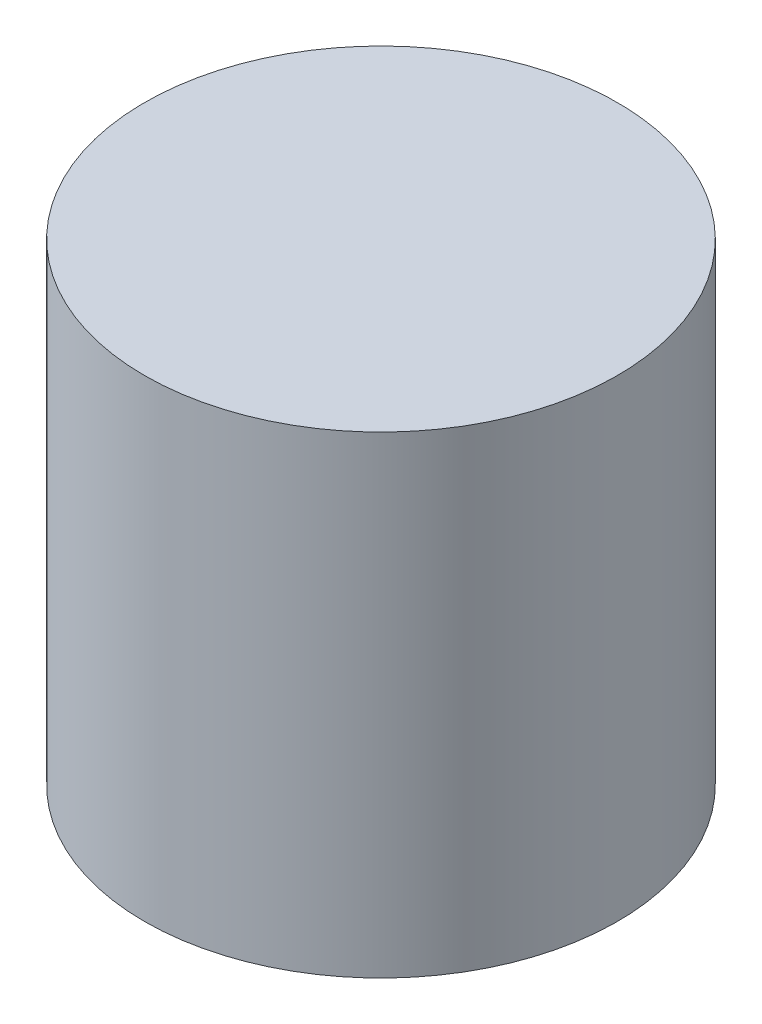
ISO-10303-21;
HEADER;
FILE_DESCRIPTION(('STEP AP214'),'2;1');
FILE_NAME('part.step','',(''),(''),'','','');
FILE_SCHEMA(('AUTOMOTIVE_DESIGN { 1 0 10303 214 1 1 1 1 }'));
ENDSEC;
DATA;
#1=APPLICATION_CONTEXT('core data for automotive mechanical design processes');
#2=APPLICATION_PROTOCOL_DEFINITION('international standard','automotive_design',2000,#1);
#3=PRODUCT_CONTEXT('',#1,'mechanical');
#4=PRODUCT('Part','Part','',(#3));
#5=PRODUCT_RELATED_PRODUCT_CATEGORY('part','',(#4));
#6=PRODUCT_DEFINITION_FORMATION('','',#4);
#7=PRODUCT_DEFINITION_CONTEXT('part definition',#1,'design');
#8=PRODUCT_DEFINITION('design','',#6,#7);
#9=PRODUCT_DEFINITION_SHAPE('','',#8);
#10=(LENGTH_UNIT() NAMED_UNIT(*) SI_UNIT(.MILLI.,.METRE.));
#11=(NAMED_UNIT(*) PLANE_ANGLE_UNIT() SI_UNIT($,.RADIAN.));
#12=(NAMED_UNIT(*) SI_UNIT($,.STERADIAN.) SOLID_ANGLE_UNIT());
#13=UNCERTAINTY_MEASURE_WITH_UNIT(LENGTH_MEASURE(1.E-05),#10,'distance_accuracy_value','');
#14=(GEOMETRIC_REPRESENTATION_CONTEXT(3) GLOBAL_UNCERTAINTY_ASSIGNED_CONTEXT((#13)) GLOBAL_UNIT_ASSIGNED_CONTEXT((#10,
#11,#12)) REPRESENTATION_CONTEXT('',''));
#15=CARTESIAN_POINT('',(0.,0.,0.));
#16=DIRECTION('',(0.,0.,1.));
#17=DIRECTION('',(1.,0.,0.));
#18=AXIS2_PLACEMENT_3D('',#15,#16,#17);
#19=CARTESIAN_POINT('',(0.,20.,0.));
#20=DIRECTION('',(0.,-1.,0.));
#21=DIRECTION('',(0.,0.,-1.));
#22=AXIS2_PLACEMENT_3D('',#19,#20,#21);
#23=CYLINDRICAL_SURFACE('',#22,10.);
#24=CARTESIAN_POINT('',(0.,20.,0.));
#25=DIRECTION('',(0.,1.,0.));
#26=DIRECTION('',(0.,0.,1.));
#27=AXIS2_PLACEMENT_3D('',#24,#25,#26);
#28=CIRCLE('',#27,10.);
#29=CARTESIAN_POINT('',(0.,20.,10.));
#30=VERTEX_POINT('',#29);
#31=EDGE_CURVE('E10',#30,#30,#28,.T.);
#32=ORIENTED_EDGE('',*,*,#31,.F.);
#33=EDGE_LOOP('',(#32));
#34=FACE_BOUND('',#33,.T.);
#35=CARTESIAN_POINT('',(0.,0.,0.));
#36=DIRECTION('',(0.,1.,0.));
#37=DIRECTION('',(0.,0.,1.));
#38=AXIS2_PLACEMENT_3D('',#35,#36,#37);
#39=CIRCLE('',#38,10.);
#40=CARTESIAN_POINT('',(0.,0.,10.));
#41=VERTEX_POINT('',#40);
#42=EDGE_CURVE('E40',#41,#41,#39,.T.);
#43=ORIENTED_EDGE('',*,*,#42,.T.);
#44=EDGE_LOOP('',(#43));
#45=FACE_BOUND('',#44,.T.);
#46=ADVANCED_FACE('F33',(#34,#45),#23,.T.);
#47=CARTESIAN_POINT('',(0.,20.,0.));
#48=DIRECTION('',(0.,1.,0.));
#49=DIRECTION('',(0.,0.,1.));
#50=AXIS2_PLACEMENT_3D('',#47,#48,#49);
#51=PLANE('',#50);
#52=ORIENTED_EDGE('',*,*,#31,.T.);
#53=EDGE_LOOP('',(#52));
#54=FACE_BOUND('',#53,.T.);
#55=ADVANCED_FACE('F75',(#54),#51,.T.);
#56=CARTESIAN_POINT('',(0.,0.,0.));
#57=DIRECTION('',(0.,1.,0.));
#58=DIRECTION('',(0.,0.,1.));
#59=AXIS2_PLACEMENT_3D('',#56,#57,#58);
#60=PLANE('',#59);
#61=CARTESIAN_POINT('',(0.,0.,0.));
#62=DIRECTION('',(0.,-1.,0.));
#63=DIRECTION('',(0.,0.,-1.));
#64=AXIS2_PLACEMENT_3D('',#61,#62,#63);
#65=CIRCLE('',#64,6.);
#66=CARTESIAN_POINT('',(0.,0.,-6.));
#67=VERTEX_POINT('',#66);
#68=EDGE_CURVE('E49',#67,#67,#65,.T.);
#69=ORIENTED_EDGE('',*,*,#68,.F.);
#70=EDGE_LOOP('',(#69));
#71=FACE_BOUND('',#70,.T.);
#72=ORIENTED_EDGE('',*,*,#42,.F.);
#73=EDGE_LOOP('',(#72));
#74=FACE_BOUND('',#73,.T.);
#75=ADVANCED_FACE('F80',(#71,#74),#60,.F.);
#76=CARTESIAN_POINT('',(0.,4.,0.));
#77=DIRECTION('',(0.,-1.,0.));
#78=DIRECTION('',(0.,0.,-1.));
#79=AXIS2_PLACEMENT_3D('',#76,#77,#78);
#80=PLANE('',#79);
#81=CARTESIAN_POINT('',(0.,4.,0.));
#82=DIRECTION('',(0.,-1.,0.));
#83=DIRECTION('',(0.,0.,-1.));
#84=AXIS2_PLACEMENT_3D('',#81,#82,#83);
#85=CIRCLE('',#84,6.);
#86=CARTESIAN_POINT('',(0.,4.,-6.));
#87=VERTEX_POINT('',#86);
#88=EDGE_CURVE('E52',#87,#87,#85,.T.);
#89=ORIENTED_EDGE('',*,*,#88,.T.);
#90=EDGE_LOOP('',(#89));
#91=FACE_BOUND('',#90,.T.);
#92=CARTESIAN_POINT('',(0.,4.,0.));
#93=DIRECTION('',(0.,-1.,0.));
#94=DIRECTION('',(0.,0.,-1.));
#95=AXIS2_PLACEMENT_3D('',#92,#93,#94);
#96=CIRCLE('',#95,3.125);
#97=CARTESIAN_POINT('',(0.,4.,-3.125));
#98=VERTEX_POINT('',#97);
#99=EDGE_CURVE('E36',#98,#98,#96,.F.);
#100=ORIENTED_EDGE('',*,*,#99,.T.);
#101=EDGE_LOOP('',(#100));
#102=FACE_BOUND('',#101,.T.);
#103=ADVANCED_FACE('F59',(#91,#102),#80,.T.);
#104=CARTESIAN_POINT('',(0.,4.,0.));
#105=DIRECTION('',(0.,-1.,0.));
#106=DIRECTION('',(0.,0.,-1.));
#107=AXIS2_PLACEMENT_3D('',#104,#105,#106);
#108=CYLINDRICAL_SURFACE('',#107,6.);
#109=ORIENTED_EDGE('',*,*,#88,.F.);
#110=EDGE_LOOP('',(#109));
#111=FACE_BOUND('',#110,.T.);
#112=ORIENTED_EDGE('',*,*,#68,.T.);
#113=EDGE_LOOP('',(#112));
#114=FACE_BOUND('',#113,.T.);
#115=ADVANCED_FACE('F69',(#111,#114),#108,.F.);
#116=CARTESIAN_POINT('',(0.,17.,0.));
#117=DIRECTION('',(0.,-1.,0.));
#118=DIRECTION('',(0.,0.,-1.));
#119=AXIS2_PLACEMENT_3D('',#116,#117,#118);
#120=PLANE('',#119);
#121=CARTESIAN_POINT('',(0.,17.,0.));
#122=DIRECTION('',(0.,-1.,0.));
#123=DIRECTION('',(0.,0.,-1.));
#124=AXIS2_PLACEMENT_3D('',#121,#122,#123);
#125=CIRCLE('',#124,3.125);
#126=CARTESIAN_POINT('',(0.,17.,-3.125));
#127=VERTEX_POINT('',#126);
#128=EDGE_CURVE('E45',#127,#127,#125,.T.);
#129=ORIENTED_EDGE('',*,*,#128,.T.);
#130=EDGE_LOOP('',(#129));
#131=FACE_BOUND('',#130,.T.);
#132=ADVANCED_FACE('F63',(#131),#120,.T.);
#133=CARTESIAN_POINT('',(0.,17.,0.));
#134=DIRECTION('',(0.,-1.,0.));
#135=DIRECTION('',(0.,0.,-1.));
#136=AXIS2_PLACEMENT_3D('',#133,#134,#135);
#137=CYLINDRICAL_SURFACE('',#136,3.125);
#138=ORIENTED_EDGE('',*,*,#128,.F.);
#139=EDGE_LOOP('',(#138));
#140=FACE_BOUND('',#139,.T.);
#141=ORIENTED_EDGE('',*,*,#99,.F.);
#142=EDGE_LOOP('',(#141));
#143=FACE_BOUND('',#142,.T.);
#144=ADVANCED_FACE('F61',(#140,#143),#137,.F.);
#145=CLOSED_SHELL('',(#46,#55,#75,#103,#115,#132,#144));
#146=MANIFOLD_SOLID_BREP('B2',#145);
#147=ADVANCED_BREP_SHAPE_REPRESENTATION('',(#18,#146),#14);
#148=SHAPE_DEFINITION_REPRESENTATION(#9,#147);
ENDSEC;
END-ISO-10303-21;
